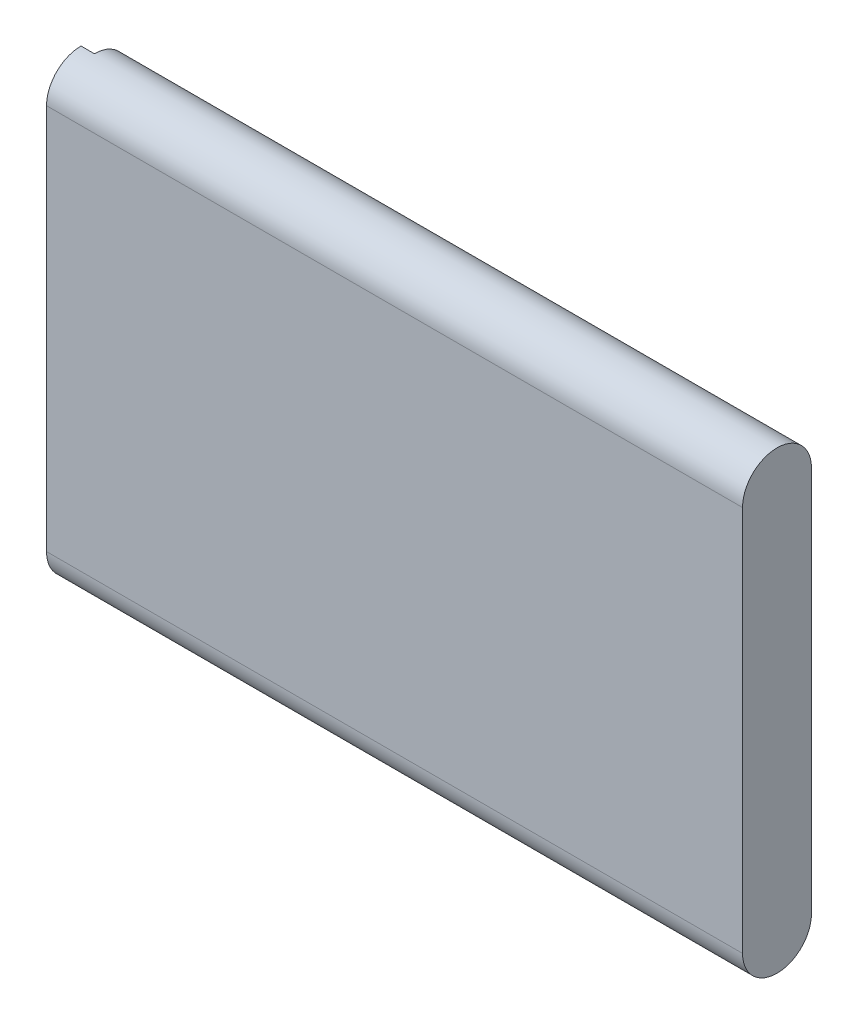
ISO-10303-21;
HEADER;
FILE_DESCRIPTION(('STEP AP214'),'2;1');
FILE_NAME('part.step','',(''),(''),'','','');
FILE_SCHEMA(('AUTOMOTIVE_DESIGN { 1 0 10303 214 1 1 1 1 }'));
ENDSEC;
DATA;
#1=APPLICATION_CONTEXT('core data for automotive mechanical design processes');
#2=APPLICATION_PROTOCOL_DEFINITION('international standard','automotive_design',2000,#1);
#3=PRODUCT_CONTEXT('',#1,'mechanical');
#4=PRODUCT('Part','Part','',(#3));
#5=PRODUCT_RELATED_PRODUCT_CATEGORY('part','',(#4));
#6=PRODUCT_DEFINITION_FORMATION('','',#4);
#7=PRODUCT_DEFINITION_CONTEXT('part definition',#1,'design');
#8=PRODUCT_DEFINITION('design','',#6,#7);
#9=PRODUCT_DEFINITION_SHAPE('','',#8);
#10=(LENGTH_UNIT() NAMED_UNIT(*) SI_UNIT(.MILLI.,.METRE.));
#11=(NAMED_UNIT(*) PLANE_ANGLE_UNIT() SI_UNIT($,.RADIAN.));
#12=(NAMED_UNIT(*) SI_UNIT($,.STERADIAN.) SOLID_ANGLE_UNIT());
#13=UNCERTAINTY_MEASURE_WITH_UNIT(LENGTH_MEASURE(1.E-05),#10,'distance_accuracy_value','');
#14=(GEOMETRIC_REPRESENTATION_CONTEXT(3) GLOBAL_UNCERTAINTY_ASSIGNED_CONTEXT((#13)) GLOBAL_UNIT_ASSIGNED_CONTEXT((#10,
#11,#12)) REPRESENTATION_CONTEXT('',''));
#15=CARTESIAN_POINT('',(0.,0.,0.));
#16=DIRECTION('',(0.,0.,1.));
#17=DIRECTION('',(1.,0.,0.));
#18=AXIS2_PLACEMENT_3D('',#15,#16,#17);
#19=CARTESIAN_POINT('',(-48.49999999999,-22.74999999999,-19.102783));
#20=DIRECTION('',(1.,0.,0.));
#21=DIRECTION('',(0.,1.,0.));
#22=AXIS2_PLACEMENT_3D('',#19,#20,#21);
#23=PLANE('',#22);
#24=DIRECTION('',(0.,1.,0.));
#25=VECTOR('',#24,1.);
#26=CARTESIAN_POINT('',(-48.49999999999,-21.49999999999,-17.102783));
#27=LINE('',#26,#25);
#28=CARTESIAN_POINT('',(-48.49999999999,-21.49999999999,-17.102783));
#29=VERTEX_POINT('',#28);
#30=CARTESIAN_POINT('',(-48.4999999999901,-23.99999999999,-17.102783));
#31=VERTEX_POINT('',#30);
#32=EDGE_CURVE('E289',#29,#31,#27,.F.);
#33=ORIENTED_EDGE('',*,*,#32,.F.);
#34=DIRECTION('',(0.,0.,1.));
#35=VECTOR('',#34,1.);
#36=CARTESIAN_POINT('',(-48.49999999999,-21.49999999999,-21.102783));
#37=LINE('',#36,#35);
#38=CARTESIAN_POINT('',(-48.49999999999,-21.49999999999,-21.102783));
#39=VERTEX_POINT('',#38);
#40=EDGE_CURVE('E294',#39,#29,#37,.T.);
#41=ORIENTED_EDGE('',*,*,#40,.F.);
#42=DIRECTION('',(0.,1.,0.));
#43=VECTOR('',#42,1.);
#44=CARTESIAN_POINT('',(-48.49999999999,-23.99999999999,-21.102783));
#45=LINE('',#44,#43);
#46=CARTESIAN_POINT('',(-48.49999999999,-23.99999999999,-21.102783));
#47=VERTEX_POINT('',#46);
#48=EDGE_CURVE('E299',#47,#39,#45,.T.);
#49=ORIENTED_EDGE('',*,*,#48,.F.);
#50=DIRECTION('',(0.,0.,1.));
#51=VECTOR('',#50,1.);
#52=CARTESIAN_POINT('',(-48.49999999999,-23.99999999999,-17.102783));
#53=LINE('',#52,#51);
#54=EDGE_CURVE('E304',#31,#47,#53,.F.);
#55=ORIENTED_EDGE('',*,*,#54,.F.);
#56=EDGE_LOOP('',(#33,#41,#49,#55));
#57=FACE_BOUND('',#56,.T.);
#58=ADVANCED_FACE('F16',(#57),#23,.F.);
#59=CARTESIAN_POINT('',(-48.49999999999,-16.75723099999,-19.102783));
#60=DIRECTION('',(1.,0.,0.));
#61=DIRECTION('',(0.,1.,0.));
#62=AXIS2_PLACEMENT_3D('',#59,#60,#61);
#63=PLANE('',#62);
#64=DIRECTION('',(0.,1.,0.));
#65=VECTOR('',#64,1.);
#66=CARTESIAN_POINT('',(-48.49999999999,-15.50723099999,-17.102783));
#67=LINE('',#66,#65);
#68=CARTESIAN_POINT('',(-48.49999999999,-15.50723099999,-17.102783));
#69=VERTEX_POINT('',#68);
#70=CARTESIAN_POINT('',(-48.4999999999901,-18.00723099999,-17.102783));
#71=VERTEX_POINT('',#70);
#72=EDGE_CURVE('E270',#69,#71,#67,.F.);
#73=ORIENTED_EDGE('',*,*,#72,.F.);
#74=DIRECTION('',(0.,0.,1.));
#75=VECTOR('',#74,1.);
#76=CARTESIAN_POINT('',(-48.49999999999,-15.50723099999,-21.102783));
#77=LINE('',#76,#75);
#78=CARTESIAN_POINT('',(-48.49999999999,-15.50723099999,-21.102783));
#79=VERTEX_POINT('',#78);
#80=EDGE_CURVE('E275',#79,#69,#77,.T.);
#81=ORIENTED_EDGE('',*,*,#80,.F.);
#82=DIRECTION('',(0.,1.,0.));
#83=VECTOR('',#82,1.);
#84=CARTESIAN_POINT('',(-48.49999999999,-18.00723099999,-21.102783));
#85=LINE('',#84,#83);
#86=CARTESIAN_POINT('',(-48.49999999999,-18.00723099999,-21.102783));
#87=VERTEX_POINT('',#86);
#88=EDGE_CURVE('E280',#87,#79,#85,.T.);
#89=ORIENTED_EDGE('',*,*,#88,.F.);
#90=DIRECTION('',(0.,0.,1.));
#91=VECTOR('',#90,1.);
#92=CARTESIAN_POINT('',(-48.49999999999,-18.00723099999,-17.102783));
#93=LINE('',#92,#91);
#94=EDGE_CURVE('E285',#71,#87,#93,.F.);
#95=ORIENTED_EDGE('',*,*,#94,.F.);
#96=EDGE_LOOP('',(#73,#81,#89,#95));
#97=FACE_BOUND('',#96,.T.);
#98=ADVANCED_FACE('F479',(#97),#63,.F.);
#99=CARTESIAN_POINT('',(-48.49999999999,-19.75361549999,-19.102783));
#100=DIRECTION('',(1.,0.,0.));
#101=DIRECTION('',(0.,1.,0.));
#102=AXIS2_PLACEMENT_3D('',#99,#100,#101);
#103=PLANE('',#102);
#104=DIRECTION('',(0.,1.,0.));
#105=VECTOR('',#104,1.);
#106=CARTESIAN_POINT('',(-48.49999999999,-18.50361549999,-17.102783));
#107=LINE('',#106,#105);
#108=CARTESIAN_POINT('',(-48.49999999999,-18.50361549999,-17.102783));
#109=VERTEX_POINT('',#108);
#110=CARTESIAN_POINT('',(-48.4999999999901,-21.00361549999,-17.102783));
#111=VERTEX_POINT('',#110);
#112=EDGE_CURVE('E200',#109,#111,#107,.F.);
#113=ORIENTED_EDGE('',*,*,#112,.F.);
#114=DIRECTION('',(0.,0.,1.));
#115=VECTOR('',#114,1.);
#116=CARTESIAN_POINT('',(-48.49999999999,-18.5036154999901,-21.102783));
#117=LINE('',#116,#115);
#118=CARTESIAN_POINT('',(-48.49999999999,-18.50361549999,-21.102783));
#119=VERTEX_POINT('',#118);
#120=EDGE_CURVE('E197',#119,#109,#117,.T.);
#121=ORIENTED_EDGE('',*,*,#120,.F.);
#122=DIRECTION('',(0.,1.,0.));
#123=VECTOR('',#122,1.);
#124=CARTESIAN_POINT('',(-48.49999999999,-21.00361549999,-21.102783));
#125=LINE('',#124,#123);
#126=CARTESIAN_POINT('',(-48.49999999999,-21.00361549999,-21.102783));
#127=VERTEX_POINT('',#126);
#128=EDGE_CURVE('E261',#127,#119,#125,.T.);
#129=ORIENTED_EDGE('',*,*,#128,.F.);
#130=DIRECTION('',(0.,0.,1.));
#131=VECTOR('',#130,1.);
#132=CARTESIAN_POINT('',(-48.49999999999,-21.00361549999,-17.102783));
#133=LINE('',#132,#131);
#134=EDGE_CURVE('E266',#111,#127,#133,.F.);
#135=ORIENTED_EDGE('',*,*,#134,.F.);
#136=EDGE_LOOP('',(#113,#121,#129,#135));
#137=FACE_BOUND('',#136,.T.);
#138=ADVANCED_FACE('F483',(#137),#103,.F.);
#139=CARTESIAN_POINT('',(-48.,-44.85913399998,-20.4875));
#140=DIRECTION('',(-1.,0.,0.));
#141=DIRECTION('',(0.,-1.,0.));
#142=AXIS2_PLACEMENT_3D('',#139,#140,#141);
#143=PLANE('',#142);
#144=CARTESIAN_POINT('',(-47.9999999999998,-43.4249999999899,-19.2));
#145=DIRECTION('',(1.,0.,0.));
#146=DIRECTION('',(0.,1.,0.));
#147=AXIS2_PLACEMENT_3D('',#144,#145,#146);
#148=CIRCLE('',#147,2.575);
#149=CARTESIAN_POINT('',(-47.9999999999999,-45.9999999999899,-19.2));
#150=VERTEX_POINT('',#149);
#151=CARTESIAN_POINT('',(-47.9999999999999,-43.42499999999,-21.775));
#152=VERTEX_POINT('',#151);
#153=EDGE_CURVE('E19',#150,#152,#148,.T.);
#154=ORIENTED_EDGE('',*,*,#153,.F.);
#155=DIRECTION('',(0.,1.,0.));
#156=VECTOR('',#155,1.);
#157=CARTESIAN_POINT('',(-48.,-46.29326799998,-19.2));
#158=LINE('',#157,#156);
#159=CARTESIAN_POINT('',(-48.,-43.42499999999,-19.2));
#160=VERTEX_POINT('',#159);
#161=EDGE_CURVE('E74',#150,#160,#158,.T.);
#162=ORIENTED_EDGE('',*,*,#161,.T.);
#163=DIRECTION('',(0.,0.,1.));
#164=VECTOR('',#163,1.);
#165=CARTESIAN_POINT('',(-48.,-43.4249999999901,-21.775));
#166=LINE('',#165,#164);
#167=EDGE_CURVE('E335',#152,#160,#166,.T.);
#168=ORIENTED_EDGE('',*,*,#167,.F.);
#169=EDGE_LOOP('',(#154,#162,#168));
#170=FACE_BOUND('',#169,.T.);
#171=ADVANCED_FACE('F488',(#170),#143,.T.);
#172=CARTESIAN_POINT('',(-49.,-43.42499999999,-21.775));
#173=DIRECTION('',(0.,-1.,0.));
#174=DIRECTION('',(1.,0.,0.));
#175=AXIS2_PLACEMENT_3D('',#172,#173,#174);
#176=PLANE('',#175);
#177=DIRECTION('',(1.,0.,0.));
#178=VECTOR('',#177,1.);
#179=CARTESIAN_POINT('',(-49.,-43.42499999999,-19.2));
#180=LINE('',#179,#178);
#181=CARTESIAN_POINT('',(-48.9999999999914,-43.42499999999,-19.2));
#182=VERTEX_POINT('',#181);
#183=EDGE_CURVE('E309',#160,#182,#180,.F.);
#184=ORIENTED_EDGE('',*,*,#183,.T.);
#185=DIRECTION('',(0.,0.,1.));
#186=VECTOR('',#185,1.);
#187=CARTESIAN_POINT('',(-48.9999999999914,-43.42499999999,-19.2));
#188=LINE('',#187,#186);
#189=CARTESIAN_POINT('',(-48.9999999999942,-43.42499999999,-21.775));
#190=VERTEX_POINT('',#189);
#191=EDGE_CURVE('E100',#190,#182,#188,.T.);
#192=ORIENTED_EDGE('',*,*,#191,.F.);
#193=DIRECTION('',(-1.,0.,0.));
#194=VECTOR('',#193,1.);
#195=CARTESIAN_POINT('',(-47.,-43.42499999999,-21.775));
#196=LINE('',#195,#194);
#197=EDGE_CURVE('E104',#152,#190,#196,.T.);
#198=ORIENTED_EDGE('',*,*,#197,.F.);
#199=ORIENTED_EDGE('',*,*,#167,.T.);
#200=EDGE_LOOP('',(#184,#192,#198,#199));
#201=FACE_BOUND('',#200,.T.);
#202=ADVANCED_FACE('F495',(#201),#176,.T.);
#203=CARTESIAN_POINT('',(-49.,-46.29326799998,-19.2));
#204=DIRECTION('',(0.,0.,1.));
#205=DIRECTION('',(1.,0.,0.));
#206=AXIS2_PLACEMENT_3D('',#203,#204,#205);
#207=PLANE('',#206);
#208=ORIENTED_EDGE('',*,*,#161,.F.);
#209=DIRECTION('',(1.,0.,0.));
#210=VECTOR('',#209,1.);
#211=CARTESIAN_POINT('',(-47.0000000000002,-45.99999999999,-19.2));
#212=LINE('',#211,#210);
#213=CARTESIAN_POINT('',(-48.9999999999959,-45.9999999999898,-19.2));
#214=VERTEX_POINT('',#213);
#215=EDGE_CURVE('E253',#214,#150,#212,.T.);
#216=ORIENTED_EDGE('',*,*,#215,.F.);
#217=DIRECTION('',(0.,-1.,0.));
#218=VECTOR('',#217,1.);
#219=CARTESIAN_POINT('',(-48.99999999999,-28.99999999999,-19.2));
#220=LINE('',#219,#218);
#221=EDGE_CURVE('E241',#182,#214,#220,.T.);
#222=ORIENTED_EDGE('',*,*,#221,.F.);
#223=ORIENTED_EDGE('',*,*,#183,.F.);
#224=EDGE_LOOP('',(#208,#216,#222,#223));
#225=FACE_BOUND('',#224,.T.);
#226=ADVANCED_FACE('F402',(#225),#207,.F.);
#227=CARTESIAN_POINT('',(-48.99999999999,-11.70673199999,-19.2));
#228=DIRECTION('',(0.,0.,-1.));
#229=DIRECTION('',(-1.,0.,0.));
#230=AXIS2_PLACEMENT_3D('',#227,#228,#229);
#231=PLANE('',#230);
#232=DIRECTION('',(0.,1.,0.));
#233=VECTOR('',#232,1.);
#234=CARTESIAN_POINT('',(-47.99999999999,-13.353366,-19.2));
#235=LINE('',#234,#233);
#236=CARTESIAN_POINT('',(-47.9999999999898,-11.99999999999,-19.2));
#237=VERTEX_POINT('',#236);
#238=CARTESIAN_POINT('',(-47.9999999999901,-14.9999999999967,-19.2));
#239=VERTEX_POINT('',#238);
#240=EDGE_CURVE('E245',#237,#239,#235,.F.);
#241=ORIENTED_EDGE('',*,*,#240,.T.);
#242=DIRECTION('',(1.,0.,0.));
#243=VECTOR('',#242,1.);
#244=CARTESIAN_POINT('',(-48.99999999999,-14.99999999999,-19.2));
#245=LINE('',#244,#243);
#246=CARTESIAN_POINT('',(-48.9999999999887,-14.99999999999,-19.2));
#247=VERTEX_POINT('',#246);
#248=EDGE_CURVE('E306',#239,#247,#245,.F.);
#249=ORIENTED_EDGE('',*,*,#248,.T.);
#250=DIRECTION('',(0.,-1.,0.));
#251=VECTOR('',#250,1.);
#252=CARTESIAN_POINT('',(-48.99999999999,-28.99999999999,-19.2));
#253=LINE('',#252,#251);
#254=CARTESIAN_POINT('',(-48.9999999999892,-11.9999999999899,-19.2));
#255=VERTEX_POINT('',#254);
#256=EDGE_CURVE('E236',#255,#247,#253,.T.);
#257=ORIENTED_EDGE('',*,*,#256,.F.);
#258=DIRECTION('',(-1.,0.,0.));
#259=VECTOR('',#258,1.);
#260=CARTESIAN_POINT('',(-48.99999999999,-11.99999999999,-19.2));
#261=LINE('',#260,#259);
#262=EDGE_CURVE('E307',#255,#237,#261,.F.);
#263=ORIENTED_EDGE('',*,*,#262,.T.);
#264=EDGE_LOOP('',(#241,#249,#257,#263));
#265=FACE_BOUND('',#264,.T.);
#266=ADVANCED_FACE('F386',(#265),#231,.T.);
#267=CARTESIAN_POINT('',(-48.99999999999,-14.99999999999,-22.2));
#268=DIRECTION('',(0.,-1.,0.));
#269=DIRECTION('',(1.,0.,0.));
#270=AXIS2_PLACEMENT_3D('',#267,#268,#269);
#271=PLANE('',#270);
#272=DIRECTION('',(0.,0.,1.));
#273=VECTOR('',#272,1.);
#274=CARTESIAN_POINT('',(-47.9999999999902,-15.,-20.7));
#275=LINE('',#274,#273);
#276=CARTESIAN_POINT('',(-47.9999999999901,-14.9999999999933,-21.775));
#277=VERTEX_POINT('',#276);
#278=EDGE_CURVE('E248',#239,#277,#275,.F.);
#279=ORIENTED_EDGE('',*,*,#278,.T.);
#280=DIRECTION('',(-1.,0.,0.));
#281=VECTOR('',#280,1.);
#282=CARTESIAN_POINT('',(-47.,-14.99999999999,-21.775));
#283=LINE('',#282,#281);
#284=CARTESIAN_POINT('',(-48.9999999999887,-14.99999999999,-21.775));
#285=VERTEX_POINT('',#284);
#286=EDGE_CURVE('E85',#285,#277,#283,.F.);
#287=ORIENTED_EDGE('',*,*,#286,.F.);
#288=DIRECTION('',(0.,0.,1.));
#289=VECTOR('',#288,1.);
#290=CARTESIAN_POINT('',(-48.9999999999887,-14.99999999999,-19.2));
#291=LINE('',#290,#289);
#292=EDGE_CURVE('E235',#247,#285,#291,.F.);
#293=ORIENTED_EDGE('',*,*,#292,.F.);
#294=ORIENTED_EDGE('',*,*,#248,.F.);
#295=EDGE_LOOP('',(#279,#287,#293,#294));
#296=FACE_BOUND('',#295,.T.);
#297=ADVANCED_FACE('F389',(#296),#271,.F.);
#298=CARTESIAN_POINT('',(-48.99999999999,-23.99999999999,-17.102783));
#299=DIRECTION('',(0.,1.,0.));
#300=DIRECTION('',(-1.,0.,0.));
#301=AXIS2_PLACEMENT_3D('',#298,#299,#300);
#302=PLANE('',#301);
#303=DIRECTION('',(1.,0.,0.));
#304=VECTOR('',#303,1.);
#305=CARTESIAN_POINT('',(-48.99999999999,-23.99999999999,-21.102783));
#306=LINE('',#305,#304);
#307=CARTESIAN_POINT('',(-48.9999999999899,-23.99999999999,-21.102783));
#308=VERTEX_POINT('',#307);
#309=EDGE_CURVE('E301',#308,#47,#306,.T.);
#310=ORIENTED_EDGE('',*,*,#309,.F.);
#311=DIRECTION('',(0.,0.,1.));
#312=VECTOR('',#311,1.);
#313=CARTESIAN_POINT('',(-48.9999999999895,-23.99999999999,-19.2));
#314=LINE('',#313,#312);
#315=CARTESIAN_POINT('',(-48.9999999999899,-23.99999999999,-17.102783));
#316=VERTEX_POINT('',#315);
#317=EDGE_CURVE('E233',#316,#308,#314,.F.);
#318=ORIENTED_EDGE('',*,*,#317,.F.);
#319=DIRECTION('',(-1.,0.,0.));
#320=VECTOR('',#319,1.);
#321=CARTESIAN_POINT('',(-48.99999999999,-23.99999999999,-17.102783));
#322=LINE('',#321,#320);
#323=EDGE_CURVE('E287',#31,#316,#322,.T.);
#324=ORIENTED_EDGE('',*,*,#323,.F.);
#325=ORIENTED_EDGE('',*,*,#54,.T.);
#326=EDGE_LOOP('',(#310,#318,#324,#325));
#327=FACE_BOUND('',#326,.T.);
#328=ADVANCED_FACE('F392',(#327),#302,.T.);
#329=CARTESIAN_POINT('',(-48.99999999999,-23.99999999999,-21.102783));
#330=DIRECTION('',(0.,0.,1.));
#331=DIRECTION('',(1.,0.,0.));
#332=AXIS2_PLACEMENT_3D('',#329,#330,#331);
#333=PLANE('',#332);
#334=DIRECTION('',(1.,0.,0.));
#335=VECTOR('',#334,1.);
#336=CARTESIAN_POINT('',(-48.99999999999,-21.49999999999,-21.102783));
#337=LINE('',#336,#335);
#338=CARTESIAN_POINT('',(-48.9999999999898,-21.49999999999,-21.102783));
#339=VERTEX_POINT('',#338);
#340=EDGE_CURVE('E296',#339,#39,#337,.T.);
#341=ORIENTED_EDGE('',*,*,#340,.F.);
#342=DIRECTION('',(0.,-1.,0.));
#343=VECTOR('',#342,1.);
#344=CARTESIAN_POINT('',(-48.99999999999,-28.99999999999,-21.102783));
#345=LINE('',#344,#343);
#346=EDGE_CURVE('E231',#308,#339,#345,.F.);
#347=ORIENTED_EDGE('',*,*,#346,.F.);
#348=ORIENTED_EDGE('',*,*,#309,.T.);
#349=ORIENTED_EDGE('',*,*,#48,.T.);
#350=EDGE_LOOP('',(#341,#347,#348,#349));
#351=FACE_BOUND('',#350,.T.);
#352=ADVANCED_FACE('F399',(#351),#333,.T.);
#353=CARTESIAN_POINT('',(-48.99999999999,-21.49999999999,-21.102783));
#354=DIRECTION('',(0.,-1.,0.));
#355=DIRECTION('',(1.,0.,0.));
#356=AXIS2_PLACEMENT_3D('',#353,#354,#355);
#357=PLANE('',#356);
#358=DIRECTION('',(-1.,0.,0.));
#359=VECTOR('',#358,1.);
#360=CARTESIAN_POINT('',(-48.99999999999,-21.49999999999,-17.102783));
#361=LINE('',#360,#359);
#362=CARTESIAN_POINT('',(-48.9999999999898,-21.49999999999,-17.102783));
#363=VERTEX_POINT('',#362);
#364=EDGE_CURVE('E291',#363,#29,#361,.F.);
#365=ORIENTED_EDGE('',*,*,#364,.F.);
#366=DIRECTION('',(0.,0.,1.));
#367=VECTOR('',#366,1.);
#368=CARTESIAN_POINT('',(-48.9999999999893,-21.49999999999,-19.2));
#369=LINE('',#368,#367);
#370=EDGE_CURVE('E229',#339,#363,#369,.T.);
#371=ORIENTED_EDGE('',*,*,#370,.F.);
#372=ORIENTED_EDGE('',*,*,#340,.T.);
#373=ORIENTED_EDGE('',*,*,#40,.T.);
#374=EDGE_LOOP('',(#365,#371,#372,#373));
#375=FACE_BOUND('',#374,.T.);
#376=ADVANCED_FACE('F455',(#375),#357,.T.);
#377=CARTESIAN_POINT('',(-48.99999999999,-21.49999999999,-17.102783));
#378=DIRECTION('',(0.,0.,-1.));
#379=DIRECTION('',(-1.,0.,0.));
#380=AXIS2_PLACEMENT_3D('',#377,#378,#379);
#381=PLANE('',#380);
#382=ORIENTED_EDGE('',*,*,#323,.T.);
#383=DIRECTION('',(0.,-1.,0.));
#384=VECTOR('',#383,1.);
#385=CARTESIAN_POINT('',(-48.99999999999,-28.99999999999,-17.102783));
#386=LINE('',#385,#384);
#387=EDGE_CURVE('E226',#363,#316,#386,.T.);
#388=ORIENTED_EDGE('',*,*,#387,.F.);
#389=ORIENTED_EDGE('',*,*,#364,.T.);
#390=ORIENTED_EDGE('',*,*,#32,.T.);
#391=EDGE_LOOP('',(#382,#388,#389,#390));
#392=FACE_BOUND('',#391,.T.);
#393=ADVANCED_FACE('F451',(#392),#381,.T.);
#394=CARTESIAN_POINT('',(-48.99999999999,-18.00723099999,-17.102783));
#395=DIRECTION('',(0.,1.,0.));
#396=DIRECTION('',(-1.,0.,0.));
#397=AXIS2_PLACEMENT_3D('',#394,#395,#396);
#398=PLANE('',#397);
#399=DIRECTION('',(1.,0.,0.));
#400=VECTOR('',#399,1.);
#401=CARTESIAN_POINT('',(-48.99999999999,-18.00723099999,-21.102783));
#402=LINE('',#401,#400);
#403=CARTESIAN_POINT('',(-48.9999999999897,-18.00723099999,-21.102783));
#404=VERTEX_POINT('',#403);
#405=EDGE_CURVE('E282',#404,#87,#402,.T.);
#406=ORIENTED_EDGE('',*,*,#405,.F.);
#407=DIRECTION('',(0.,0.,1.));
#408=VECTOR('',#407,1.);
#409=CARTESIAN_POINT('',(-48.999999999989,-18.00723099999,-19.2));
#410=LINE('',#409,#408);
#411=CARTESIAN_POINT('',(-48.9999999999897,-18.00723099999,-17.102783));
#412=VERTEX_POINT('',#411);
#413=EDGE_CURVE('E224',#412,#404,#410,.F.);
#414=ORIENTED_EDGE('',*,*,#413,.F.);
#415=DIRECTION('',(-1.,0.,0.));
#416=VECTOR('',#415,1.);
#417=CARTESIAN_POINT('',(-48.99999999999,-18.00723099999,-17.102783));
#418=LINE('',#417,#416);
#419=EDGE_CURVE('E268',#71,#412,#418,.T.);
#420=ORIENTED_EDGE('',*,*,#419,.F.);
#421=ORIENTED_EDGE('',*,*,#94,.T.);
#422=EDGE_LOOP('',(#406,#414,#420,#421));
#423=FACE_BOUND('',#422,.T.);
#424=ADVANCED_FACE('F447',(#423),#398,.T.);
#425=CARTESIAN_POINT('',(-48.99999999999,-18.00723099999,-21.102783));
#426=DIRECTION('',(0.,0.,1.));
#427=DIRECTION('',(1.,0.,0.));
#428=AXIS2_PLACEMENT_3D('',#425,#426,#427);
#429=PLANE('',#428);
#430=DIRECTION('',(1.,0.,0.));
#431=VECTOR('',#430,1.);
#432=CARTESIAN_POINT('',(-48.99999999999,-15.50723099999,-21.102783));
#433=LINE('',#432,#431);
#434=CARTESIAN_POINT('',(-48.9999999999897,-15.50723099999,-21.102783));
#435=VERTEX_POINT('',#434);
#436=EDGE_CURVE('E277',#435,#79,#433,.T.);
#437=ORIENTED_EDGE('',*,*,#436,.F.);
#438=DIRECTION('',(0.,-1.,0.));
#439=VECTOR('',#438,1.);
#440=CARTESIAN_POINT('',(-48.99999999999,-28.99999999999,-21.102783));
#441=LINE('',#440,#439);
#442=EDGE_CURVE('E222',#404,#435,#441,.F.);
#443=ORIENTED_EDGE('',*,*,#442,.F.);
#444=ORIENTED_EDGE('',*,*,#405,.T.);
#445=ORIENTED_EDGE('',*,*,#88,.T.);
#446=EDGE_LOOP('',(#437,#443,#444,#445));
#447=FACE_BOUND('',#446,.T.);
#448=ADVANCED_FACE('F443',(#447),#429,.T.);
#449=CARTESIAN_POINT('',(-48.99999999999,-15.50723099999,-21.102783));
#450=DIRECTION('',(0.,-1.,0.));
#451=DIRECTION('',(1.,0.,0.));
#452=AXIS2_PLACEMENT_3D('',#449,#450,#451);
#453=PLANE('',#452);
#454=DIRECTION('',(-1.,0.,0.));
#455=VECTOR('',#454,1.);
#456=CARTESIAN_POINT('',(-48.99999999999,-15.50723099999,-17.102783));
#457=LINE('',#456,#455);
#458=CARTESIAN_POINT('',(-48.9999999999897,-15.50723099999,-17.102783));
#459=VERTEX_POINT('',#458);
#460=EDGE_CURVE('E272',#459,#69,#457,.F.);
#461=ORIENTED_EDGE('',*,*,#460,.F.);
#462=DIRECTION('',(0.,0.,1.));
#463=VECTOR('',#462,1.);
#464=CARTESIAN_POINT('',(-48.9999999999887,-15.50723099999,-19.2));
#465=LINE('',#464,#463);
#466=EDGE_CURVE('E220',#435,#459,#465,.T.);
#467=ORIENTED_EDGE('',*,*,#466,.F.);
#468=ORIENTED_EDGE('',*,*,#436,.T.);
#469=ORIENTED_EDGE('',*,*,#80,.T.);
#470=EDGE_LOOP('',(#461,#467,#468,#469));
#471=FACE_BOUND('',#470,.T.);
#472=ADVANCED_FACE('F439',(#471),#453,.T.);
#473=CARTESIAN_POINT('',(-48.99999999999,-15.50723099999,-17.102783));
#474=DIRECTION('',(0.,0.,-1.));
#475=DIRECTION('',(-1.,0.,0.));
#476=AXIS2_PLACEMENT_3D('',#473,#474,#475);
#477=PLANE('',#476);
#478=ORIENTED_EDGE('',*,*,#419,.T.);
#479=DIRECTION('',(0.,-1.,0.));
#480=VECTOR('',#479,1.);
#481=CARTESIAN_POINT('',(-48.99999999999,-28.99999999999,-17.102783));
#482=LINE('',#481,#480);
#483=EDGE_CURVE('E217',#459,#412,#482,.T.);
#484=ORIENTED_EDGE('',*,*,#483,.F.);
#485=ORIENTED_EDGE('',*,*,#460,.T.);
#486=ORIENTED_EDGE('',*,*,#72,.T.);
#487=EDGE_LOOP('',(#478,#484,#485,#486));
#488=FACE_BOUND('',#487,.T.);
#489=ADVANCED_FACE('F435',(#488),#477,.T.);
#490=CARTESIAN_POINT('',(-48.99999999999,-21.00361549999,-17.102783));
#491=DIRECTION('',(0.,1.,0.));
#492=DIRECTION('',(-1.,0.,0.));
#493=AXIS2_PLACEMENT_3D('',#490,#491,#492);
#494=PLANE('',#493);
#495=DIRECTION('',(1.,0.,0.));
#496=VECTOR('',#495,1.);
#497=CARTESIAN_POINT('',(-48.99999999999,-21.00361549999,-21.102783));
#498=LINE('',#497,#496);
#499=CARTESIAN_POINT('',(-48.9999999999898,-21.00361549999,-21.102783));
#500=VERTEX_POINT('',#499);
#501=EDGE_CURVE('E263',#500,#127,#498,.T.);
#502=ORIENTED_EDGE('',*,*,#501,.F.);
#503=DIRECTION('',(0.,0.,1.));
#504=VECTOR('',#503,1.);
#505=CARTESIAN_POINT('',(-48.9999999999892,-21.00361549999,-19.2));
#506=LINE('',#505,#504);
#507=CARTESIAN_POINT('',(-48.9999999999898,-21.00361549999,-17.102783));
#508=VERTEX_POINT('',#507);
#509=EDGE_CURVE('E215',#508,#500,#506,.F.);
#510=ORIENTED_EDGE('',*,*,#509,.F.);
#511=DIRECTION('',(-1.,0.,0.));
#512=VECTOR('',#511,1.);
#513=CARTESIAN_POINT('',(-48.99999999999,-21.00361549999,-17.102783));
#514=LINE('',#513,#512);
#515=EDGE_CURVE('E204',#111,#508,#514,.T.);
#516=ORIENTED_EDGE('',*,*,#515,.F.);
#517=ORIENTED_EDGE('',*,*,#134,.T.);
#518=EDGE_LOOP('',(#502,#510,#516,#517));
#519=FACE_BOUND('',#518,.T.);
#520=ADVANCED_FACE('F431',(#519),#494,.T.);
#521=CARTESIAN_POINT('',(-48.99999999999,-21.00361549999,-21.102783));
#522=DIRECTION('',(0.,0.,1.));
#523=DIRECTION('',(1.,0.,0.));
#524=AXIS2_PLACEMENT_3D('',#521,#522,#523);
#525=PLANE('',#524);
#526=DIRECTION('',(1.,0.,0.));
#527=VECTOR('',#526,1.);
#528=CARTESIAN_POINT('',(-48.99999999999,-18.50361549999,-21.102783));
#529=LINE('',#528,#527);
#530=CARTESIAN_POINT('',(-48.9999999999898,-18.50361549999,-21.102783));
#531=VERTEX_POINT('',#530);
#532=EDGE_CURVE('E259',#531,#119,#529,.T.);
#533=ORIENTED_EDGE('',*,*,#532,.F.);
#534=DIRECTION('',(0.,-1.,0.));
#535=VECTOR('',#534,1.);
#536=CARTESIAN_POINT('',(-48.99999999999,-28.99999999999,-21.102783));
#537=LINE('',#536,#535);
#538=EDGE_CURVE('E188',#500,#531,#537,.F.);
#539=ORIENTED_EDGE('',*,*,#538,.F.);
#540=ORIENTED_EDGE('',*,*,#501,.T.);
#541=ORIENTED_EDGE('',*,*,#128,.T.);
#542=EDGE_LOOP('',(#533,#539,#540,#541));
#543=FACE_BOUND('',#542,.T.);
#544=ADVANCED_FACE('F428',(#543),#525,.T.);
#545=CARTESIAN_POINT('',(-48.99999999999,-18.50361549999,-21.102783));
#546=DIRECTION('',(0.,-1.,0.));
#547=DIRECTION('',(1.,0.,0.));
#548=AXIS2_PLACEMENT_3D('',#545,#546,#547);
#549=PLANE('',#548);
#550=DIRECTION('',(-1.,0.,0.));
#551=VECTOR('',#550,1.);
#552=CARTESIAN_POINT('',(-48.99999999999,-18.50361549999,-17.102783));
#553=LINE('',#552,#551);
#554=CARTESIAN_POINT('',(-48.9999999999898,-18.50361549999,-17.102783));
#555=VERTEX_POINT('',#554);
#556=EDGE_CURVE('E194',#555,#109,#553,.F.);
#557=ORIENTED_EDGE('',*,*,#556,.F.);
#558=DIRECTION('',(0.,0.,1.));
#559=VECTOR('',#558,1.);
#560=CARTESIAN_POINT('',(-48.999999999989,-18.50361549999,-19.2));
#561=LINE('',#560,#559);
#562=EDGE_CURVE('E180',#531,#555,#561,.T.);
#563=ORIENTED_EDGE('',*,*,#562,.F.);
#564=ORIENTED_EDGE('',*,*,#532,.T.);
#565=ORIENTED_EDGE('',*,*,#120,.T.);
#566=EDGE_LOOP('',(#557,#563,#564,#565));
#567=FACE_BOUND('',#566,.T.);
#568=ADVANCED_FACE('F195',(#567),#549,.T.);
#569=CARTESIAN_POINT('',(-48.99999999999,-18.50361549999,-17.102783));
#570=DIRECTION('',(0.,0.,-1.));
#571=DIRECTION('',(-1.,0.,0.));
#572=AXIS2_PLACEMENT_3D('',#569,#570,#571);
#573=PLANE('',#572);
#574=ORIENTED_EDGE('',*,*,#515,.T.);
#575=DIRECTION('',(0.,-1.,0.));
#576=VECTOR('',#575,1.);
#577=CARTESIAN_POINT('',(-48.99999999999,-28.99999999999,-17.102783));
#578=LINE('',#577,#576);
#579=EDGE_CURVE('E185',#555,#508,#578,.T.);
#580=ORIENTED_EDGE('',*,*,#579,.F.);
#581=ORIENTED_EDGE('',*,*,#556,.T.);
#582=ORIENTED_EDGE('',*,*,#112,.T.);
#583=EDGE_LOOP('',(#574,#580,#581,#582));
#584=FACE_BOUND('',#583,.T.);
#585=ADVANCED_FACE('F202',(#584),#573,.T.);
#586=CARTESIAN_POINT('',(-47.99999999999,-13.353366,-20.7));
#587=DIRECTION('',(1.,0.,0.));
#588=DIRECTION('',(0.,1.,0.));
#589=AXIS2_PLACEMENT_3D('',#586,#587,#588);
#590=PLANE('',#589);
#591=CARTESIAN_POINT('',(-47.99999999999,-14.5749999999899,-19.2));
#592=DIRECTION('',(1.,0.,0.));
#593=DIRECTION('',(0.,1.,0.));
#594=AXIS2_PLACEMENT_3D('',#591,#592,#593);
#595=CIRCLE('',#594,2.575);
#596=CARTESIAN_POINT('',(-47.99999999999,-14.5749999999899,-21.775));
#597=VERTEX_POINT('',#596);
#598=EDGE_CURVE('E205',#597,#237,#595,.T.);
#599=ORIENTED_EDGE('',*,*,#598,.F.);
#600=DIRECTION('',(0.,1.,0.));
#601=VECTOR('',#600,1.);
#602=CARTESIAN_POINT('',(-47.99999999999,-43.42499999999,-21.775));
#603=LINE('',#602,#601);
#604=EDGE_CURVE('E251',#277,#597,#603,.T.);
#605=ORIENTED_EDGE('',*,*,#604,.F.);
#606=ORIENTED_EDGE('',*,*,#278,.F.);
#607=ORIENTED_EDGE('',*,*,#240,.F.);
#608=EDGE_LOOP('',(#599,#605,#606,#607));
#609=FACE_BOUND('',#608,.T.);
#610=ADVANCED_FACE('F420',(#609),#590,.F.);
#611=CARTESIAN_POINT('',(-48.99999999999,-28.99999999999,-19.2));
#612=DIRECTION('',(-1.,0.,0.));
#613=DIRECTION('',(0.,-1.,0.));
#614=AXIS2_PLACEMENT_3D('',#611,#612,#613);
#615=PLANE('',#614);
#616=ORIENTED_EDGE('',*,*,#562,.T.);
#617=ORIENTED_EDGE('',*,*,#579,.T.);
#618=ORIENTED_EDGE('',*,*,#509,.T.);
#619=ORIENTED_EDGE('',*,*,#538,.T.);
#620=EDGE_LOOP('',(#616,#617,#618,#619));
#621=FACE_BOUND('',#620,.T.);
#622=ORIENTED_EDGE('',*,*,#466,.T.);
#623=ORIENTED_EDGE('',*,*,#483,.T.);
#624=ORIENTED_EDGE('',*,*,#413,.T.);
#625=ORIENTED_EDGE('',*,*,#442,.T.);
#626=EDGE_LOOP('',(#622,#623,#624,#625));
#627=FACE_BOUND('',#626,.T.);
#628=ORIENTED_EDGE('',*,*,#370,.T.);
#629=ORIENTED_EDGE('',*,*,#387,.T.);
#630=ORIENTED_EDGE('',*,*,#317,.T.);
#631=ORIENTED_EDGE('',*,*,#346,.T.);
#632=EDGE_LOOP('',(#628,#629,#630,#631));
#633=FACE_BOUND('',#632,.T.);
#634=ORIENTED_EDGE('',*,*,#256,.T.);
#635=ORIENTED_EDGE('',*,*,#292,.T.);
#636=DIRECTION('',(0.,-1.,0.));
#637=VECTOR('',#636,1.);
#638=CARTESIAN_POINT('',(-48.99999999999,-28.99999999999,-21.775));
#639=LINE('',#638,#637);
#640=EDGE_CURVE('E322',#285,#190,#639,.T.);
#641=ORIENTED_EDGE('',*,*,#640,.T.);
#642=ORIENTED_EDGE('',*,*,#191,.T.);
#643=ORIENTED_EDGE('',*,*,#221,.T.);
#644=CARTESIAN_POINT('',(-49.,-43.4249999999898,-19.2));
#645=DIRECTION('',(1.,0.,0.));
#646=DIRECTION('',(0.,1.,0.));
#647=AXIS2_PLACEMENT_3D('',#644,#645,#646);
#648=CIRCLE('',#647,2.575);
#649=CARTESIAN_POINT('',(-49.,-43.4249999999899,-16.625));
#650=VERTEX_POINT('',#649);
#651=EDGE_CURVE('E238',#214,#650,#648,.F.);
#652=ORIENTED_EDGE('',*,*,#651,.T.);
#653=DIRECTION('',(0.,1.,0.));
#654=VECTOR('',#653,1.);
#655=CARTESIAN_POINT('',(-49.,-43.42499999999,-16.625));
#656=LINE('',#655,#654);
#657=CARTESIAN_POINT('',(-48.9999999999951,-14.5749999999899,-16.625));
#658=VERTEX_POINT('',#657);
#659=EDGE_CURVE('E211',#650,#658,#656,.T.);
#660=ORIENTED_EDGE('',*,*,#659,.T.);
#661=CARTESIAN_POINT('',(-48.9999999999902,-14.5749999999898,-19.2));
#662=DIRECTION('',(1.,0.,0.));
#663=DIRECTION('',(0.,1.,0.));
#664=AXIS2_PLACEMENT_3D('',#661,#662,#663);
#665=CIRCLE('',#664,2.575);
#666=EDGE_CURVE('E208',#255,#658,#665,.T.);
#667=ORIENTED_EDGE('',*,*,#666,.F.);
#668=EDGE_LOOP('',(#634,#635,#641,#642,#643,#652,#660,#667));
#669=FACE_BOUND('',#668,.T.);
#670=ADVANCED_FACE('F182',(#621,#627,#633,#669),#615,.T.);
#671=CARTESIAN_POINT('',(2.999999999999,-43.425,-21.775));
#672=DIRECTION('',(0.,0.,-1.));
#673=DIRECTION('',(-1.,0.,0.));
#674=AXIS2_PLACEMENT_3D('',#671,#672,#673);
#675=PLANE('',#674);
#676=DIRECTION('',(1.,0.,0.));
#677=VECTOR('',#676,1.);
#678=CARTESIAN_POINT('',(3.00000000000101,-14.575,-21.775));
#679=LINE('',#678,#677);
#680=CARTESIAN_POINT('',(3.00000000000119,-14.575,-21.775));
#681=VERTEX_POINT('',#680);
#682=EDGE_CURVE('E350',#681,#597,#679,.F.);
#683=ORIENTED_EDGE('',*,*,#682,.F.);
#684=DIRECTION('',(0.,-1.,0.));
#685=VECTOR('',#684,1.);
#686=CARTESIAN_POINT('',(3.00000000000001,-29.,-21.775));
#687=LINE('',#686,#685);
#688=CARTESIAN_POINT('',(2.99999999999882,-43.4249999999974,-21.775));
#689=VERTEX_POINT('',#688);
#690=EDGE_CURVE('E346',#681,#689,#687,.T.);
#691=ORIENTED_EDGE('',*,*,#690,.T.);
#692=DIRECTION('',(1.,0.,0.));
#693=VECTOR('',#692,1.);
#694=CARTESIAN_POINT('',(2.99999999999901,-43.4249999999947,-21.775));
#695=LINE('',#694,#693);
#696=EDGE_CURVE('E352',#152,#689,#695,.T.);
#697=ORIENTED_EDGE('',*,*,#696,.F.);
#698=ORIENTED_EDGE('',*,*,#197,.T.);
#699=ORIENTED_EDGE('',*,*,#640,.F.);
#700=ORIENTED_EDGE('',*,*,#286,.T.);
#701=ORIENTED_EDGE('',*,*,#604,.T.);
#702=EDGE_LOOP('',(#683,#691,#697,#698,#699,#700,#701));
#703=FACE_BOUND('',#702,.T.);
#704=ADVANCED_FACE('F379',(#703),#675,.T.);
#705=CARTESIAN_POINT('',(2.999999999999,-43.425,-19.2));
#706=DIRECTION('',(1.,0.,0.));
#707=DIRECTION('',(0.,1.,0.));
#708=AXIS2_PLACEMENT_3D('',#705,#706,#707);
#709=CYLINDRICAL_SURFACE('',#708,2.575);
#710=DIRECTION('',(-1.,0.,0.));
#711=VECTOR('',#710,1.);
#712=CARTESIAN_POINT('',(2.999999999999,-43.425,-16.625));
#713=LINE('',#712,#711);
#714=CARTESIAN_POINT('',(2.99999999999999,-43.425,-16.625));
#715=VERTEX_POINT('',#714);
#716=EDGE_CURVE('E362',#715,#650,#713,.T.);
#717=ORIENTED_EDGE('',*,*,#716,.T.);
#718=ORIENTED_EDGE('',*,*,#651,.F.);
#719=ORIENTED_EDGE('',*,*,#215,.T.);
#720=ORIENTED_EDGE('',*,*,#153,.T.);
#721=ORIENTED_EDGE('',*,*,#696,.T.);
#722=CARTESIAN_POINT('',(2.99999999999899,-43.425,-19.2));
#723=DIRECTION('',(1.,0.,0.));
#724=DIRECTION('',(0.,1.,0.));
#725=AXIS2_PLACEMENT_3D('',#722,#723,#724);
#726=CIRCLE('',#725,2.575);
#727=EDGE_CURVE('E347',#689,#715,#726,.F.);
#728=ORIENTED_EDGE('',*,*,#727,.T.);
#729=EDGE_LOOP('',(#717,#718,#719,#720,#721,#728));
#730=FACE_BOUND('',#729,.T.);
#731=ADVANCED_FACE('F413',(#730),#709,.T.);
#732=CARTESIAN_POINT('',(3.000000000001,-14.575,-19.2));
#733=DIRECTION('',(1.,0.,0.));
#734=DIRECTION('',(0.,1.,0.));
#735=AXIS2_PLACEMENT_3D('',#732,#733,#734);
#736=CYLINDRICAL_SURFACE('',#735,2.575);
#737=ORIENTED_EDGE('',*,*,#682,.T.);
#738=ORIENTED_EDGE('',*,*,#598,.T.);
#739=ORIENTED_EDGE('',*,*,#262,.F.);
#740=ORIENTED_EDGE('',*,*,#666,.T.);
#741=DIRECTION('',(-1.,0.,0.));
#742=VECTOR('',#741,1.);
#743=CARTESIAN_POINT('',(2.999999999999,-14.57499999999,-16.625));
#744=LINE('',#743,#742);
#745=CARTESIAN_POINT('',(3.000000000001,-14.574999999995,-16.625));
#746=VERTEX_POINT('',#745);
#747=EDGE_CURVE('E25',#658,#746,#744,.F.);
#748=ORIENTED_EDGE('',*,*,#747,.T.);
#749=CARTESIAN_POINT('',(3.00000000000101,-14.575,-19.2));
#750=DIRECTION('',(1.,0.,0.));
#751=DIRECTION('',(0.,1.,0.));
#752=AXIS2_PLACEMENT_3D('',#749,#750,#751);
#753=CIRCLE('',#752,2.575);
#754=EDGE_CURVE('E33',#746,#681,#753,.F.);
#755=ORIENTED_EDGE('',*,*,#754,.T.);
#756=EDGE_LOOP('',(#737,#738,#739,#740,#748,#755));
#757=FACE_BOUND('',#756,.T.);
#758=ADVANCED_FACE('F383',(#757),#736,.T.);
#759=CARTESIAN_POINT('',(3.,-29.,-19.2));
#760=DIRECTION('',(-1.,0.,0.));
#761=DIRECTION('',(0.,-1.,0.));
#762=AXIS2_PLACEMENT_3D('',#759,#760,#761);
#763=PLANE('',#762);
#764=ORIENTED_EDGE('',*,*,#754,.F.);
#765=DIRECTION('',(0.,1.,0.));
#766=VECTOR('',#765,1.);
#767=CARTESIAN_POINT('',(3.000000000001,-43.425,-16.625));
#768=LINE('',#767,#766);
#769=EDGE_CURVE('E10',#746,#715,#768,.F.);
#770=ORIENTED_EDGE('',*,*,#769,.T.);
#771=ORIENTED_EDGE('',*,*,#727,.F.);
#772=ORIENTED_EDGE('',*,*,#690,.F.);
#773=EDGE_LOOP('',(#764,#770,#771,#772));
#774=FACE_BOUND('',#773,.T.);
#775=ADVANCED_FACE('F381',(#774),#763,.F.);
#776=CARTESIAN_POINT('',(2.999999999999,-43.425,-16.625));
#777=DIRECTION('',(0.,0.,-1.));
#778=DIRECTION('',(-1.,0.,0.));
#779=AXIS2_PLACEMENT_3D('',#776,#777,#778);
#780=PLANE('',#779);
#781=ORIENTED_EDGE('',*,*,#747,.F.);
#782=ORIENTED_EDGE('',*,*,#659,.F.);
#783=ORIENTED_EDGE('',*,*,#716,.F.);
#784=ORIENTED_EDGE('',*,*,#769,.F.);
#785=EDGE_LOOP('',(#781,#782,#783,#784));
#786=FACE_BOUND('',#785,.T.);
#787=ADVANCED_FACE('F361',(#786),#780,.F.);
#788=CLOSED_SHELL('',(#58,#98,#138,#171,#202,#226,#266,#297,#328,#352,#376,#393,#424,#448,#472,
#489,#520,#544,#568,#585,#610,#670,#704,#731,#758,#775,#787));
#789=MANIFOLD_SOLID_BREP('B1',#788);
#790=ADVANCED_BREP_SHAPE_REPRESENTATION('',(#18,#789),#14);
#791=SHAPE_DEFINITION_REPRESENTATION(#9,#790);
ENDSEC;
END-ISO-10303-21;
